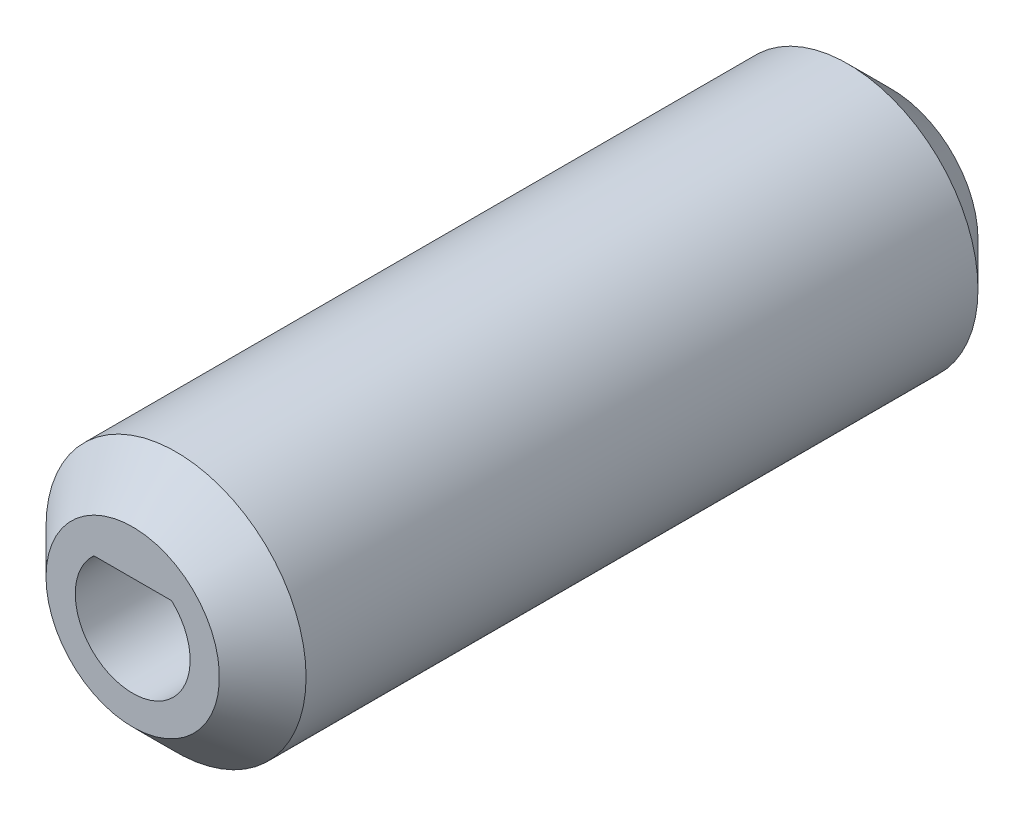
ISO-10303-21;
HEADER;
FILE_DESCRIPTION(('STEP AP214'),'2;1');
FILE_NAME('part.step','',(''),(''),'','','');
FILE_SCHEMA(('AUTOMOTIVE_DESIGN { 1 0 10303 214 1 1 1 1 }'));
ENDSEC;
DATA;
#1=APPLICATION_CONTEXT('core data for automotive mechanical design processes');
#2=APPLICATION_PROTOCOL_DEFINITION('international standard','automotive_design',2000,#1);
#3=PRODUCT_CONTEXT('',#1,'mechanical');
#4=PRODUCT('Part','Part','',(#3));
#5=PRODUCT_RELATED_PRODUCT_CATEGORY('part','',(#4));
#6=PRODUCT_DEFINITION_FORMATION('','',#4);
#7=PRODUCT_DEFINITION_CONTEXT('part definition',#1,'design');
#8=PRODUCT_DEFINITION('design','',#6,#7);
#9=PRODUCT_DEFINITION_SHAPE('','',#8);
#10=(LENGTH_UNIT() NAMED_UNIT(*) SI_UNIT(.MILLI.,.METRE.));
#11=(NAMED_UNIT(*) PLANE_ANGLE_UNIT() SI_UNIT($,.RADIAN.));
#12=(NAMED_UNIT(*) SI_UNIT($,.STERADIAN.) SOLID_ANGLE_UNIT());
#13=UNCERTAINTY_MEASURE_WITH_UNIT(LENGTH_MEASURE(1.E-05),#10,'distance_accuracy_value','');
#14=(GEOMETRIC_REPRESENTATION_CONTEXT(3) GLOBAL_UNCERTAINTY_ASSIGNED_CONTEXT((#13)) GLOBAL_UNIT_ASSIGNED_CONTEXT((#10,
#11,#12)) REPRESENTATION_CONTEXT('',''));
#15=CARTESIAN_POINT('',(0.,0.,0.));
#16=DIRECTION('',(0.,0.,1.));
#17=DIRECTION('',(1.,0.,0.));
#18=AXIS2_PLACEMENT_3D('',#15,#16,#17);
#19=CARTESIAN_POINT('',(0.,1.95,-3.65650105975644));
#20=DIRECTION('',(0.,-1.,0.));
#21=DIRECTION('',(0.,0.,-1.));
#22=AXIS2_PLACEMENT_3D('',#19,#20,#21);
#23=PLANE('',#22);
#24=DIRECTION('',(1.,0.,0.));
#25=VECTOR('',#24,1.);
#26=CARTESIAN_POINT('',(0.,1.95,35.));
#27=LINE('',#26,#25);
#28=CARTESIAN_POINT('',(-1.79443584449264,1.95,35.));
#29=VERTEX_POINT('',#28);
#30=CARTESIAN_POINT('',(1.79443584449264,1.95,35.));
#31=VERTEX_POINT('',#30);
#32=EDGE_CURVE('E50',#29,#31,#27,.T.);
#33=ORIENTED_EDGE('',*,*,#32,.F.);
#34=DIRECTION('',(0.,0.,-1.));
#35=VECTOR('',#34,1.);
#36=CARTESIAN_POINT('',(-1.79443584449264,1.95,35.));
#37=LINE('',#36,#35);
#38=CARTESIAN_POINT('',(-1.79443584449264,1.95,0.));
#39=VERTEX_POINT('',#38);
#40=EDGE_CURVE('E52',#29,#39,#37,.T.);
#41=ORIENTED_EDGE('',*,*,#40,.T.);
#42=DIRECTION('',(1.,0.,0.));
#43=VECTOR('',#42,1.);
#44=CARTESIAN_POINT('',(0.,1.95,0.));
#45=LINE('',#44,#43);
#46=CARTESIAN_POINT('',(1.79443584449264,1.95,0.));
#47=VERTEX_POINT('',#46);
#48=EDGE_CURVE('E51',#39,#47,#45,.T.);
#49=ORIENTED_EDGE('',*,*,#48,.T.);
#50=DIRECTION('',(0.,0.,-1.));
#51=VECTOR('',#50,1.);
#52=CARTESIAN_POINT('',(1.79443584449264,1.95,35.));
#53=LINE('',#52,#51);
#54=EDGE_CURVE('E55',#47,#31,#53,.F.);
#55=ORIENTED_EDGE('',*,*,#54,.T.);
#56=EDGE_LOOP('',(#33,#41,#49,#55));
#57=FACE_BOUND('',#56,.T.);
#58=ADVANCED_FACE('F17',(#57),#23,.T.);
#59=CARTESIAN_POINT('',(0.,0.,35.));
#60=DIRECTION('',(0.,0.,-1.));
#61=DIRECTION('',(-1.,0.,0.));
#62=AXIS2_PLACEMENT_3D('',#59,#60,#61);
#63=CYLINDRICAL_SURFACE('',#62,2.65);
#64=ORIENTED_EDGE('',*,*,#40,.F.);
#65=CARTESIAN_POINT('',(0.,0.,35.));
#66=DIRECTION('',(0.,0.,-1.));
#67=DIRECTION('',(-1.,0.,0.));
#68=AXIS2_PLACEMENT_3D('',#65,#66,#67);
#69=CIRCLE('',#68,2.65);
#70=EDGE_CURVE('E20',#31,#29,#69,.T.);
#71=ORIENTED_EDGE('',*,*,#70,.F.);
#72=ORIENTED_EDGE('',*,*,#54,.F.);
#73=CARTESIAN_POINT('',(0.,0.,0.));
#74=DIRECTION('',(0.,0.,-1.));
#75=DIRECTION('',(-1.,0.,0.));
#76=AXIS2_PLACEMENT_3D('',#73,#74,#75);
#77=CIRCLE('',#76,2.65);
#78=EDGE_CURVE('E34',#47,#39,#77,.T.);
#79=ORIENTED_EDGE('',*,*,#78,.T.);
#80=EDGE_LOOP('',(#64,#71,#72,#79));
#81=FACE_BOUND('',#80,.T.);
#82=ADVANCED_FACE('F53',(#81),#63,.F.);
#83=CARTESIAN_POINT('',(0.,0.,35.));
#84=DIRECTION('',(0.,0.,1.));
#85=DIRECTION('',(1.,0.,0.));
#86=AXIS2_PLACEMENT_3D('',#83,#84,#85);
#87=PLANE('',#86);
#88=ORIENTED_EDGE('',*,*,#32,.T.);
#89=ORIENTED_EDGE('',*,*,#70,.T.);
#90=EDGE_LOOP('',(#88,#89));
#91=FACE_BOUND('',#90,.T.);
#92=CARTESIAN_POINT('',(0.,0.,35.0000000000819));
#93=DIRECTION('',(0.,0.,-1.));
#94=DIRECTION('',(-1.,0.,0.));
#95=AXIS2_PLACEMENT_3D('',#92,#93,#94);
#96=CIRCLE('',#95,3.99999999996226);
#97=CARTESIAN_POINT('',(-3.99999999996226,0.,35.0000000000819));
#98=VERTEX_POINT('',#97);
#99=EDGE_CURVE('E65',#98,#98,#96,.T.);
#100=ORIENTED_EDGE('',*,*,#99,.F.);
#101=EDGE_LOOP('',(#100));
#102=FACE_BOUND('',#101,.T.);
#103=ADVANCED_FACE('F47',(#91,#102),#87,.T.);
#104=CARTESIAN_POINT('',(0.,0.,0.));
#105=DIRECTION('',(0.,0.,1.));
#106=DIRECTION('',(1.,0.,0.));
#107=AXIS2_PLACEMENT_3D('',#104,#105,#106);
#108=PLANE('',#107);
#109=ORIENTED_EDGE('',*,*,#78,.F.);
#110=ORIENTED_EDGE('',*,*,#48,.F.);
#111=EDGE_LOOP('',(#109,#110));
#112=FACE_BOUND('',#111,.T.);
#113=CARTESIAN_POINT('',(0.,0.,5.6843418860808E-11));
#114=DIRECTION('',(0.,0.,1.));
#115=DIRECTION('',(1.,0.,0.));
#116=AXIS2_PLACEMENT_3D('',#113,#114,#115);
#117=CIRCLE('',#116,4.0000000000191);
#118=CARTESIAN_POINT('',(4.0000000000191,0.,5.6843418860808E-11));
#119=VERTEX_POINT('',#118);
#120=EDGE_CURVE('E62',#119,#119,#117,.T.);
#121=ORIENTED_EDGE('',*,*,#120,.F.);
#122=EDGE_LOOP('',(#121));
#123=FACE_BOUND('',#122,.T.);
#124=ADVANCED_FACE('F67',(#112,#123),#108,.F.);
#125=CARTESIAN_POINT('',(0.,0.,33.0000000001291));
#126=DIRECTION('',(0.,0.,-1.));
#127=DIRECTION('',(-1.,0.,0.));
#128=AXIS2_PLACEMENT_3D('',#125,#126,#127);
#129=CONICAL_SURFACE('',#128,5.99999999991496,0.785398163397448);
#130=CARTESIAN_POINT('',(0.,0.,33.));
#131=DIRECTION('',(0.,0.,-1.));
#132=DIRECTION('',(-1.,0.,0.));
#133=AXIS2_PLACEMENT_3D('',#130,#131,#132);
#134=CIRCLE('',#133,6.);
#135=CARTESIAN_POINT('',(-6.,0.,33.));
#136=VERTEX_POINT('',#135);
#137=EDGE_CURVE('E26',#136,#136,#134,.T.);
#138=ORIENTED_EDGE('',*,*,#137,.F.);
#139=EDGE_LOOP('',(#138));
#140=FACE_BOUND('',#139,.T.);
#141=ORIENTED_EDGE('',*,*,#99,.T.);
#142=EDGE_LOOP('',(#141));
#143=FACE_BOUND('',#142,.T.);
#144=ADVANCED_FACE('F70',(#140,#143),#129,.T.);
#145=CARTESIAN_POINT('',(0.,0.,2.00000000000955));
#146=DIRECTION('',(0.,0.,1.));
#147=DIRECTION('',(1.,0.,0.));
#148=AXIS2_PLACEMENT_3D('',#145,#146,#147);
#149=CONICAL_SURFACE('',#148,5.99999999991496,0.785398163383238);
#150=CARTESIAN_POINT('',(0.,0.,2.));
#151=DIRECTION('',(0.,0.,-1.));
#152=DIRECTION('',(-1.,0.,0.));
#153=AXIS2_PLACEMENT_3D('',#150,#151,#152);
#154=CIRCLE('',#153,6.);
#155=CARTESIAN_POINT('',(-6.,0.,2.));
#156=VERTEX_POINT('',#155);
#157=EDGE_CURVE('E11',#156,#156,#154,.F.);
#158=ORIENTED_EDGE('',*,*,#157,.F.);
#159=EDGE_LOOP('',(#158));
#160=FACE_BOUND('',#159,.T.);
#161=ORIENTED_EDGE('',*,*,#120,.T.);
#162=EDGE_LOOP('',(#161));
#163=FACE_BOUND('',#162,.T.);
#164=ADVANCED_FACE('F74',(#160,#163),#149,.T.);
#165=CARTESIAN_POINT('',(0.,0.,35.));
#166=DIRECTION('',(0.,0.,-1.));
#167=DIRECTION('',(-1.,0.,0.));
#168=AXIS2_PLACEMENT_3D('',#165,#166,#167);
#169=CYLINDRICAL_SURFACE('',#168,6.);
#170=ORIENTED_EDGE('',*,*,#157,.T.);
#171=EDGE_LOOP('',(#170));
#172=FACE_BOUND('',#171,.T.);
#173=ORIENTED_EDGE('',*,*,#137,.T.);
#174=EDGE_LOOP('',(#173));
#175=FACE_BOUND('',#174,.T.);
#176=ADVANCED_FACE('F76',(#172,#175),#169,.T.);
#177=CLOSED_SHELL('',(#58,#82,#103,#124,#144,#164,#176));
#178=MANIFOLD_SOLID_BREP('B1',#177);
#179=ADVANCED_BREP_SHAPE_REPRESENTATION('',(#18,#178),#14);
#180=SHAPE_DEFINITION_REPRESENTATION(#9,#179);
ENDSEC;
END-ISO-10303-21;
